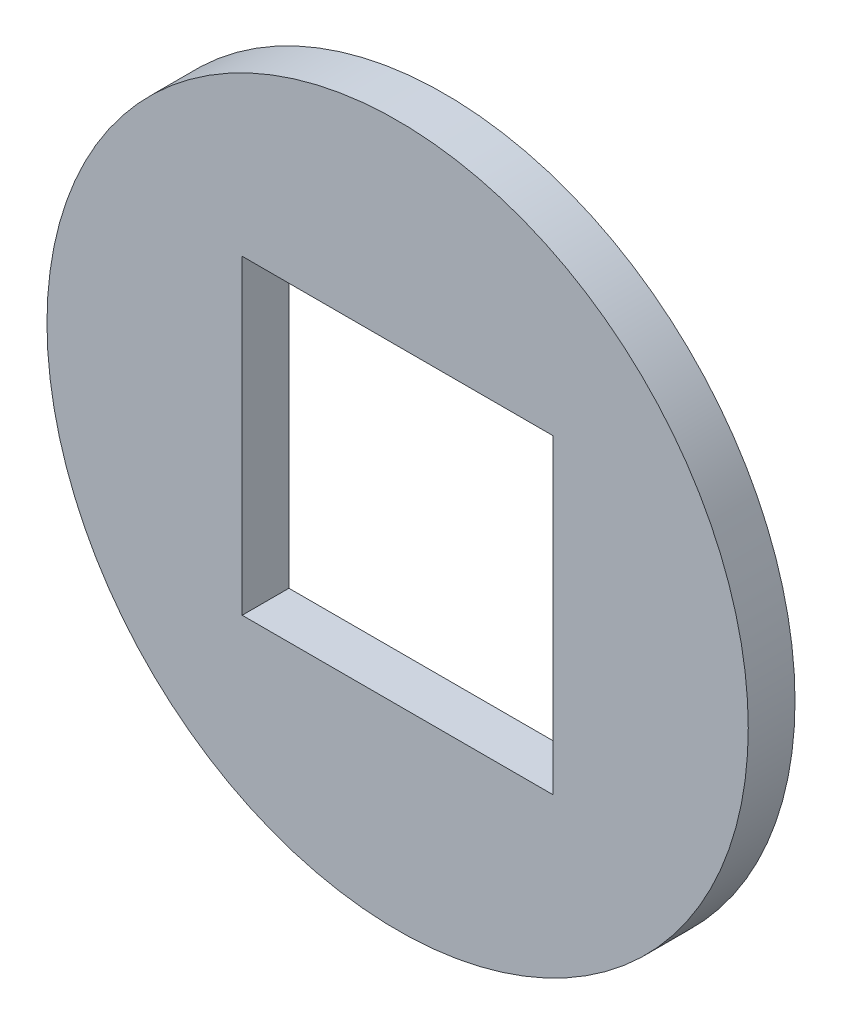
ISO-10303-21;
HEADER;
FILE_DESCRIPTION(('STEP AP214'),'2;1');
FILE_NAME('part.step','',(''),(''),'','','');
FILE_SCHEMA(('AUTOMOTIVE_DESIGN { 1 0 10303 214 1 1 1 1 }'));
ENDSEC;
DATA;
#1=APPLICATION_CONTEXT('core data for automotive mechanical design processes');
#2=APPLICATION_PROTOCOL_DEFINITION('international standard','automotive_design',2000,#1);
#3=PRODUCT_CONTEXT('',#1,'mechanical');
#4=PRODUCT('Part','Part','',(#3));
#5=PRODUCT_RELATED_PRODUCT_CATEGORY('part','',(#4));
#6=PRODUCT_DEFINITION_FORMATION('','',#4);
#7=PRODUCT_DEFINITION_CONTEXT('part definition',#1,'design');
#8=PRODUCT_DEFINITION('design','',#6,#7);
#9=PRODUCT_DEFINITION_SHAPE('','',#8);
#10=(LENGTH_UNIT() NAMED_UNIT(*) SI_UNIT(.MILLI.,.METRE.));
#11=(NAMED_UNIT(*) PLANE_ANGLE_UNIT() SI_UNIT($,.RADIAN.));
#12=(NAMED_UNIT(*) SI_UNIT($,.STERADIAN.) SOLID_ANGLE_UNIT());
#13=UNCERTAINTY_MEASURE_WITH_UNIT(LENGTH_MEASURE(1.E-05),#10,'distance_accuracy_value','');
#14=(GEOMETRIC_REPRESENTATION_CONTEXT(3) GLOBAL_UNCERTAINTY_ASSIGNED_CONTEXT((#13)) GLOBAL_UNIT_ASSIGNED_CONTEXT((#10,
#11,#12)) REPRESENTATION_CONTEXT('',''));
#15=CARTESIAN_POINT('',(0.,0.,0.));
#16=DIRECTION('',(0.,0.,1.));
#17=DIRECTION('',(1.,0.,0.));
#18=AXIS2_PLACEMENT_3D('',#15,#16,#17);
#19=CARTESIAN_POINT('',(0.,0.,0.5));
#20=DIRECTION('',(0.,0.,1.));
#21=DIRECTION('',(1.,0.,0.));
#22=AXIS2_PLACEMENT_3D('',#19,#20,#21);
#23=PLANE('',#22);
#24=CARTESIAN_POINT('',(0.,0.,0.5));
#25=DIRECTION('',(0.,0.,1.));
#26=DIRECTION('',(1.,0.,0.));
#27=AXIS2_PLACEMENT_3D('',#24,#25,#26);
#28=CIRCLE('',#27,7.5);
#29=CARTESIAN_POINT('',(7.5,0.,0.5));
#30=VERTEX_POINT('',#29);
#31=EDGE_CURVE('E11',#30,#30,#28,.T.);
#32=ORIENTED_EDGE('',*,*,#31,.T.);
#33=EDGE_LOOP('',(#32));
#34=FACE_BOUND('',#33,.T.);
#35=DIRECTION('',(-1.,0.,0.));
#36=VECTOR('',#35,1.);
#37=CARTESIAN_POINT('',(-3.325,3.325,0.5));
#38=LINE('',#37,#36);
#39=CARTESIAN_POINT('',(3.325,3.325,0.5));
#40=VERTEX_POINT('',#39);
#41=CARTESIAN_POINT('',(-3.325,3.325,0.5));
#42=VERTEX_POINT('',#41);
#43=EDGE_CURVE('E90',#40,#42,#38,.T.);
#44=ORIENTED_EDGE('',*,*,#43,.F.);
#45=DIRECTION('',(0.,1.,0.));
#46=VECTOR('',#45,1.);
#47=CARTESIAN_POINT('',(3.325,-3.325,0.5));
#48=LINE('',#47,#46);
#49=CARTESIAN_POINT('',(3.325,-3.325,0.5));
#50=VERTEX_POINT('',#49);
#51=EDGE_CURVE('E82',#50,#40,#48,.T.);
#52=ORIENTED_EDGE('',*,*,#51,.F.);
#53=DIRECTION('',(1.,0.,0.));
#54=VECTOR('',#53,1.);
#55=CARTESIAN_POINT('',(-3.325,-3.325,0.5));
#56=LINE('',#55,#54);
#57=CARTESIAN_POINT('',(-3.325,-3.325,0.5));
#58=VERTEX_POINT('',#57);
#59=EDGE_CURVE('E103',#58,#50,#56,.T.);
#60=ORIENTED_EDGE('',*,*,#59,.F.);
#61=DIRECTION('',(0.,-1.,0.));
#62=VECTOR('',#61,1.);
#63=CARTESIAN_POINT('',(-3.325,-3.325,0.5));
#64=LINE('',#63,#62);
#65=EDGE_CURVE('E101',#42,#58,#64,.T.);
#66=ORIENTED_EDGE('',*,*,#65,.F.);
#67=EDGE_LOOP('',(#44,#52,#60,#66));
#68=FACE_BOUND('',#67,.T.);
#69=ADVANCED_FACE('F41',(#34,#68),#23,.T.);
#70=CARTESIAN_POINT('',(0.,0.,-0.5));
#71=DIRECTION('',(0.,0.,1.));
#72=DIRECTION('',(1.,0.,0.));
#73=AXIS2_PLACEMENT_3D('',#70,#71,#72);
#74=PLANE('',#73);
#75=CARTESIAN_POINT('',(0.,0.,-0.5));
#76=DIRECTION('',(0.,0.,1.));
#77=DIRECTION('',(1.,0.,0.));
#78=AXIS2_PLACEMENT_3D('',#75,#76,#77);
#79=CIRCLE('',#78,7.5);
#80=CARTESIAN_POINT('',(7.5,0.,-0.5));
#81=VERTEX_POINT('',#80);
#82=EDGE_CURVE('E45',#81,#81,#79,.T.);
#83=ORIENTED_EDGE('',*,*,#82,.F.);
#84=EDGE_LOOP('',(#83));
#85=FACE_BOUND('',#84,.T.);
#86=DIRECTION('',(0.,1.,0.));
#87=VECTOR('',#86,1.);
#88=CARTESIAN_POINT('',(3.325,-3.325,-0.5));
#89=LINE('',#88,#87);
#90=CARTESIAN_POINT('',(3.325,-3.325,-0.5));
#91=VERTEX_POINT('',#90);
#92=CARTESIAN_POINT('',(3.325,3.325,-0.5));
#93=VERTEX_POINT('',#92);
#94=EDGE_CURVE('E64',#91,#93,#89,.T.);
#95=ORIENTED_EDGE('',*,*,#94,.T.);
#96=DIRECTION('',(-1.,0.,0.));
#97=VECTOR('',#96,1.);
#98=CARTESIAN_POINT('',(-3.325,3.325,-0.5));
#99=LINE('',#98,#97);
#100=CARTESIAN_POINT('',(-3.325,3.325,-0.5));
#101=VERTEX_POINT('',#100);
#102=EDGE_CURVE('E97',#93,#101,#99,.T.);
#103=ORIENTED_EDGE('',*,*,#102,.T.);
#104=DIRECTION('',(0.,-1.,0.));
#105=VECTOR('',#104,1.);
#106=CARTESIAN_POINT('',(-3.325,-3.325,-0.5));
#107=LINE('',#106,#105);
#108=CARTESIAN_POINT('',(-3.325,-3.325,-0.5));
#109=VERTEX_POINT('',#108);
#110=EDGE_CURVE('E109',#101,#109,#107,.T.);
#111=ORIENTED_EDGE('',*,*,#110,.T.);
#112=DIRECTION('',(1.,0.,0.));
#113=VECTOR('',#112,1.);
#114=CARTESIAN_POINT('',(-3.325,-3.325,-0.5));
#115=LINE('',#114,#113);
#116=EDGE_CURVE('E91',#109,#91,#115,.T.);
#117=ORIENTED_EDGE('',*,*,#116,.T.);
#118=EDGE_LOOP('',(#95,#103,#111,#117));
#119=FACE_BOUND('',#118,.T.);
#120=ADVANCED_FACE('F120',(#85,#119),#74,.F.);
#121=CARTESIAN_POINT('',(0.,0.,0.5));
#122=DIRECTION('',(0.,0.,-1.));
#123=DIRECTION('',(-1.,0.,0.));
#124=AXIS2_PLACEMENT_3D('',#121,#122,#123);
#125=CYLINDRICAL_SURFACE('',#124,7.5);
#126=ORIENTED_EDGE('',*,*,#31,.F.);
#127=EDGE_LOOP('',(#126));
#128=FACE_BOUND('',#127,.T.);
#129=ORIENTED_EDGE('',*,*,#82,.T.);
#130=EDGE_LOOP('',(#129));
#131=FACE_BOUND('',#130,.T.);
#132=ADVANCED_FACE('F43',(#128,#131),#125,.T.);
#133=CARTESIAN_POINT('',(3.325,-3.325,0.5));
#134=DIRECTION('',(-1.,0.,0.));
#135=DIRECTION('',(0.,0.,1.));
#136=AXIS2_PLACEMENT_3D('',#133,#134,#135);
#137=PLANE('',#136);
#138=ORIENTED_EDGE('',*,*,#94,.F.);
#139=DIRECTION('',(0.,0.,-1.));
#140=VECTOR('',#139,1.);
#141=CARTESIAN_POINT('',(3.325,-3.325,0.5));
#142=LINE('',#141,#140);
#143=EDGE_CURVE('E86',#50,#91,#142,.T.);
#144=ORIENTED_EDGE('',*,*,#143,.F.);
#145=ORIENTED_EDGE('',*,*,#51,.T.);
#146=DIRECTION('',(0.,0.,-1.));
#147=VECTOR('',#146,1.);
#148=CARTESIAN_POINT('',(3.325,3.325,0.5));
#149=LINE('',#148,#147);
#150=EDGE_CURVE('E85',#40,#93,#149,.T.);
#151=ORIENTED_EDGE('',*,*,#150,.T.);
#152=EDGE_LOOP('',(#138,#144,#145,#151));
#153=FACE_BOUND('',#152,.T.);
#154=ADVANCED_FACE('F84',(#153),#137,.T.);
#155=CARTESIAN_POINT('',(-3.325,3.325,0.5));
#156=DIRECTION('',(0.,-1.,0.));
#157=DIRECTION('',(0.,0.,-1.));
#158=AXIS2_PLACEMENT_3D('',#155,#156,#157);
#159=PLANE('',#158);
#160=ORIENTED_EDGE('',*,*,#102,.F.);
#161=ORIENTED_EDGE('',*,*,#150,.F.);
#162=ORIENTED_EDGE('',*,*,#43,.T.);
#163=DIRECTION('',(0.,0.,-1.));
#164=VECTOR('',#163,1.);
#165=CARTESIAN_POINT('',(-3.325,3.325,0.5));
#166=LINE('',#165,#164);
#167=EDGE_CURVE('E98',#42,#101,#166,.T.);
#168=ORIENTED_EDGE('',*,*,#167,.T.);
#169=EDGE_LOOP('',(#160,#161,#162,#168));
#170=FACE_BOUND('',#169,.T.);
#171=ADVANCED_FACE('F94',(#170),#159,.T.);
#172=CARTESIAN_POINT('',(-3.325,-3.325,0.5));
#173=DIRECTION('',(1.,0.,0.));
#174=DIRECTION('',(0.,0.,-1.));
#175=AXIS2_PLACEMENT_3D('',#172,#173,#174);
#176=PLANE('',#175);
#177=ORIENTED_EDGE('',*,*,#110,.F.);
#178=ORIENTED_EDGE('',*,*,#167,.F.);
#179=ORIENTED_EDGE('',*,*,#65,.T.);
#180=DIRECTION('',(0.,0.,-1.));
#181=VECTOR('',#180,1.);
#182=CARTESIAN_POINT('',(-3.325,-3.325,0.5));
#183=LINE('',#182,#181);
#184=EDGE_CURVE('E56',#58,#109,#183,.T.);
#185=ORIENTED_EDGE('',*,*,#184,.T.);
#186=EDGE_LOOP('',(#177,#178,#179,#185));
#187=FACE_BOUND('',#186,.T.);
#188=ADVANCED_FACE('F118',(#187),#176,.T.);
#189=CARTESIAN_POINT('',(-3.325,-3.325,0.5));
#190=DIRECTION('',(0.,1.,0.));
#191=DIRECTION('',(0.,0.,1.));
#192=AXIS2_PLACEMENT_3D('',#189,#190,#191);
#193=PLANE('',#192);
#194=ORIENTED_EDGE('',*,*,#116,.F.);
#195=ORIENTED_EDGE('',*,*,#184,.F.);
#196=ORIENTED_EDGE('',*,*,#59,.T.);
#197=ORIENTED_EDGE('',*,*,#143,.T.);
#198=EDGE_LOOP('',(#194,#195,#196,#197));
#199=FACE_BOUND('',#198,.T.);
#200=ADVANCED_FACE('F121',(#199),#193,.T.);
#201=CLOSED_SHELL('',(#69,#120,#132,#154,#171,#188,#200));
#202=MANIFOLD_SOLID_BREP('B2',#201);
#203=ADVANCED_BREP_SHAPE_REPRESENTATION('',(#18,#202),#14);
#204=SHAPE_DEFINITION_REPRESENTATION(#9,#203);
ENDSEC;
END-ISO-10303-21;
